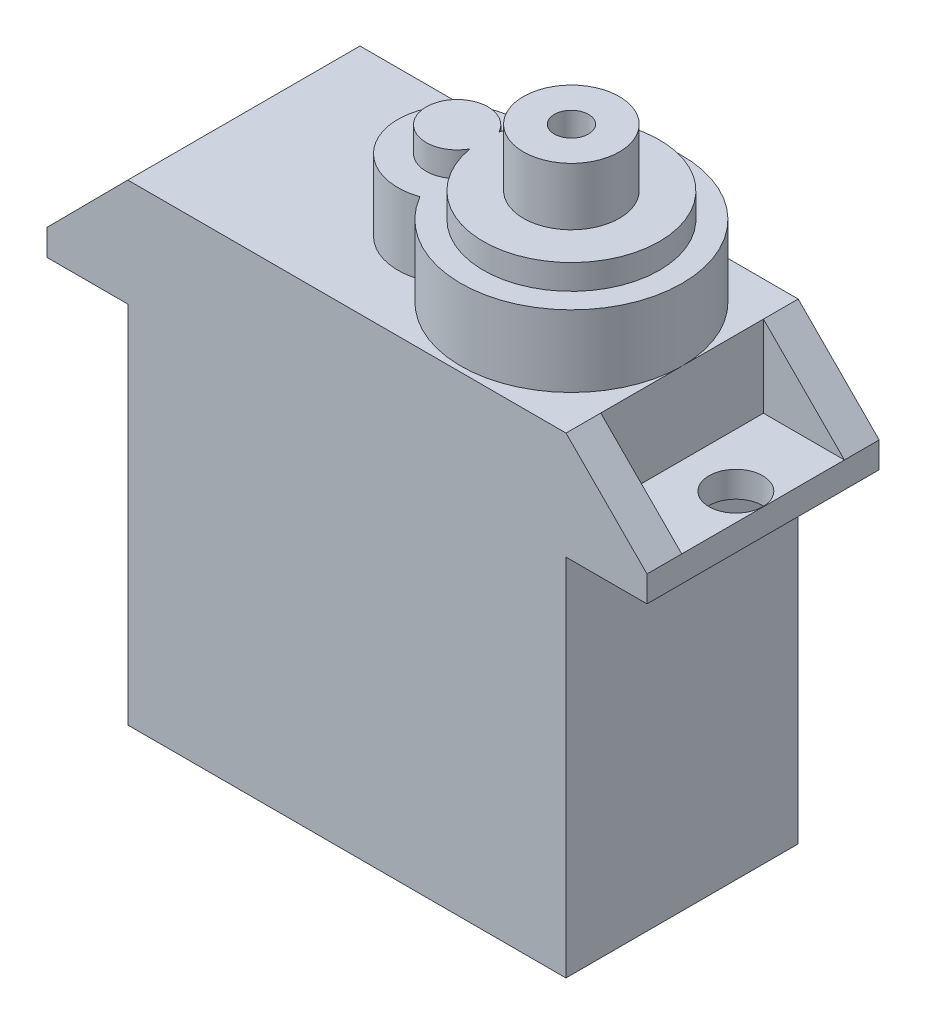
ISO-10303-21;
HEADER;
FILE_DESCRIPTION(('STEP AP214'),'2;1');
FILE_NAME('part.step','',(''),(''),'','','');
FILE_SCHEMA(('AUTOMOTIVE_DESIGN { 1 0 10303 214 1 1 1 1 }'));
ENDSEC;
DATA;
#1=APPLICATION_CONTEXT('core data for automotive mechanical design processes');
#2=APPLICATION_PROTOCOL_DEFINITION('international standard','automotive_design',2000,#1);
#3=PRODUCT_CONTEXT('',#1,'mechanical');
#4=PRODUCT('Part','Part','',(#3));
#5=PRODUCT_RELATED_PRODUCT_CATEGORY('part','',(#4));
#6=PRODUCT_DEFINITION_FORMATION('','',#4);
#7=PRODUCT_DEFINITION_CONTEXT('part definition',#1,'design');
#8=PRODUCT_DEFINITION('design','',#6,#7);
#9=PRODUCT_DEFINITION_SHAPE('','',#8);
#10=(LENGTH_UNIT() NAMED_UNIT(*) SI_UNIT(.MILLI.,.METRE.));
#11=(NAMED_UNIT(*) PLANE_ANGLE_UNIT() SI_UNIT($,.RADIAN.));
#12=(NAMED_UNIT(*) SI_UNIT($,.STERADIAN.) SOLID_ANGLE_UNIT());
#13=UNCERTAINTY_MEASURE_WITH_UNIT(LENGTH_MEASURE(1.E-05),#10,'distance_accuracy_value','');
#14=(GEOMETRIC_REPRESENTATION_CONTEXT(3) GLOBAL_UNCERTAINTY_ASSIGNED_CONTEXT((#13)) GLOBAL_UNIT_ASSIGNED_CONTEXT((#10,
#11,#12)) REPRESENTATION_CONTEXT('',''));
#15=CARTESIAN_POINT('',(0.,0.,0.));
#16=DIRECTION('',(0.,0.,1.));
#17=DIRECTION('',(1.,0.,0.));
#18=AXIS2_PLACEMENT_3D('',#15,#16,#17);
#19=CARTESIAN_POINT('',(0.,29.63,0.));
#20=DIRECTION('',(0.,1.,0.));
#21=DIRECTION('',(0.,0.,1.));
#22=AXIS2_PLACEMENT_3D('',#19,#20,#21);
#23=PLANE('',#22);
#24=CARTESIAN_POINT('',(-0.305000000000001,29.63,0.));
#25=DIRECTION('',(0.,1.,0.));
#26=DIRECTION('',(0.,0.,1.));
#27=AXIS2_PLACEMENT_3D('',#24,#25,#26);
#28=CIRCLE('',#27,1.61);
#29=CARTESIAN_POINT('',(1.12119857262804,29.63,-0.747032550451273));
#30=VERTEX_POINT('',#29);
#31=CARTESIAN_POINT('',(1.12119857262804,29.63,0.747032550451273));
#32=VERTEX_POINT('',#31);
#33=EDGE_CURVE('E221',#30,#32,#28,.T.);
#34=ORIENTED_EDGE('',*,*,#33,.T.);
#35=CARTESIAN_POINT('',(5.65,29.63,0.));
#36=DIRECTION('',(0.,1.,0.));
#37=DIRECTION('',(0.,0.,1.));
#38=AXIS2_PLACEMENT_3D('',#35,#36,#37);
#39=CIRCLE('',#38,4.59);
#40=EDGE_CURVE('E211',#32,#30,#39,.T.);
#41=ORIENTED_EDGE('',*,*,#40,.T.);
#42=EDGE_LOOP('',(#34,#41));
#43=FACE_BOUND('',#42,.T.);
#44=CARTESIAN_POINT('',(5.65,29.63,0.));
#45=DIRECTION('',(0.,1.,0.));
#46=DIRECTION('',(0.,0.,1.));
#47=AXIS2_PLACEMENT_3D('',#44,#45,#46);
#48=CIRCLE('',#47,2.5);
#49=CARTESIAN_POINT('',(5.65,29.63,2.5));
#50=VERTEX_POINT('',#49);
#51=EDGE_CURVE('E228',#50,#50,#48,.T.);
#52=ORIENTED_EDGE('',*,*,#51,.F.);
#53=EDGE_LOOP('',(#52));
#54=FACE_BOUND('',#53,.T.);
#55=ADVANCED_FACE('F66',(#43,#54),#23,.T.);
#56=CARTESIAN_POINT('',(0.,28.33,0.));
#57=DIRECTION('',(0.,1.,0.));
#58=DIRECTION('',(0.,0.,1.));
#59=AXIS2_PLACEMENT_3D('',#56,#57,#58);
#60=PLANE('',#59);
#61=CARTESIAN_POINT('',(-0.305000000000001,28.33,0.));
#62=DIRECTION('',(0.,1.,0.));
#63=DIRECTION('',(0.,0.,1.));
#64=AXIS2_PLACEMENT_3D('',#61,#62,#63);
#65=CIRCLE('',#64,3.085);
#66=CARTESIAN_POINT('',(0.676221662468512,28.33,-2.92479555680436));
#67=VERTEX_POINT('',#66);
#68=CARTESIAN_POINT('',(0.676221662468512,28.33,2.92479555680436));
#69=VERTEX_POINT('',#68);
#70=EDGE_CURVE('E233',#67,#69,#65,.T.);
#71=ORIENTED_EDGE('',*,*,#70,.T.);
#72=CARTESIAN_POINT('',(5.65,28.33,0.));
#73=DIRECTION('',(0.,1.,0.));
#74=DIRECTION('',(0.,0.,1.));
#75=AXIS2_PLACEMENT_3D('',#72,#73,#74);
#76=CIRCLE('',#75,5.77);
#77=EDGE_CURVE('E236',#69,#67,#76,.T.);
#78=ORIENTED_EDGE('',*,*,#77,.T.);
#79=EDGE_LOOP('',(#71,#78));
#80=FACE_BOUND('',#79,.T.);
#81=CARTESIAN_POINT('',(5.65,28.33,0.));
#82=DIRECTION('',(0.,1.,0.));
#83=DIRECTION('',(0.,0.,1.));
#84=AXIS2_PLACEMENT_3D('',#81,#82,#83);
#85=CIRCLE('',#84,4.59);
#86=CARTESIAN_POINT('',(1.12119857262804,28.33,0.747032550451273));
#87=VERTEX_POINT('',#86);
#88=CARTESIAN_POINT('',(1.12119857262804,28.33,-0.747032550451273));
#89=VERTEX_POINT('',#88);
#90=EDGE_CURVE('E214',#87,#89,#85,.T.);
#91=ORIENTED_EDGE('',*,*,#90,.F.);
#92=CARTESIAN_POINT('',(-0.305000000000001,28.33,0.));
#93=DIRECTION('',(0.,1.,0.));
#94=DIRECTION('',(0.,0.,1.));
#95=AXIS2_PLACEMENT_3D('',#92,#93,#94);
#96=CIRCLE('',#95,1.61);
#97=EDGE_CURVE('E83',#89,#87,#96,.T.);
#98=ORIENTED_EDGE('',*,*,#97,.F.);
#99=EDGE_LOOP('',(#91,#98));
#100=FACE_BOUND('',#99,.T.);
#101=ADVANCED_FACE('F451',(#80,#100),#60,.T.);
#102=CARTESIAN_POINT('',(-15.64,20.35,-6.05005));
#103=DIRECTION('',(0.709606840581156,-0.704597851118232,0.));
#104=DIRECTION('',(0.704597851118232,0.709606840581156,0.));
#105=AXIS2_PLACEMENT_3D('',#102,#103,#104);
#106=PLANE('',#105);
#107=DIRECTION('',(0.,0.,1.));
#108=VECTOR('',#107,1.);
#109=CARTESIAN_POINT('',(-15.64,20.35,-6.05005));
#110=LINE('',#109,#108);
#111=CARTESIAN_POINT('',(-15.64,20.35,-6.05));
#112=VERTEX_POINT('',#111);
#113=CARTESIAN_POINT('',(-15.64,20.35,-4.24));
#114=VERTEX_POINT('',#113);
#115=EDGE_CURVE('E306',#112,#114,#110,.T.);
#116=ORIENTED_EDGE('',*,*,#115,.T.);
#117=DIRECTION('',(0.704597851118232,0.709606840581156,0.));
#118=VECTOR('',#117,1.);
#119=CARTESIAN_POINT('',(-15.64,20.35,-4.24));
#120=LINE('',#119,#118);
#121=CARTESIAN_POINT('',(-11.42,24.6,-4.24));
#122=VERTEX_POINT('',#121);
#123=EDGE_CURVE('E70',#114,#122,#120,.T.);
#124=ORIENTED_EDGE('',*,*,#123,.T.);
#125=DIRECTION('',(0.,0.,-1.));
#126=VECTOR('',#125,1.);
#127=CARTESIAN_POINT('',(-11.42,24.6,0.));
#128=LINE('',#127,#126);
#129=CARTESIAN_POINT('',(-11.42,24.6,-6.05));
#130=VERTEX_POINT('',#129);
#131=EDGE_CURVE('E386',#122,#130,#128,.T.);
#132=ORIENTED_EDGE('',*,*,#131,.T.);
#133=DIRECTION('',(0.704597851118232,0.709606840581156,0.));
#134=VECTOR('',#133,1.);
#135=CARTESIAN_POINT('',(-14.2174474574098,21.7826654753575,-6.05));
#136=LINE('',#135,#134);
#137=EDGE_CURVE('E309',#112,#130,#136,.T.);
#138=ORIENTED_EDGE('',*,*,#137,.F.);
#139=EDGE_LOOP('',(#116,#124,#132,#138));
#140=FACE_BOUND('',#139,.T.);
#141=ADVANCED_FACE('F412',(#140),#106,.F.);
#142=CARTESIAN_POINT('',(15.64,20.35,-6.05005));
#143=DIRECTION('',(-0.709606840581156,-0.704597851118232,0.));
#144=DIRECTION('',(0.704597851118232,-0.709606840581156,0.));
#145=AXIS2_PLACEMENT_3D('',#142,#143,#144);
#146=PLANE('',#145);
#147=DIRECTION('',(0.,0.,1.));
#148=VECTOR('',#147,1.);
#149=CARTESIAN_POINT('',(11.42,24.6,0.));
#150=LINE('',#149,#148);
#151=CARTESIAN_POINT('',(11.42,24.6,-6.05));
#152=VERTEX_POINT('',#151);
#153=CARTESIAN_POINT('',(11.42,24.6,-4.24));
#154=VERTEX_POINT('',#153);
#155=EDGE_CURVE('E396',#152,#154,#150,.T.);
#156=ORIENTED_EDGE('',*,*,#155,.T.);
#157=DIRECTION('',(0.704597851118232,-0.709606840581156,0.));
#158=VECTOR('',#157,1.);
#159=CARTESIAN_POINT('',(15.64,20.35,-4.24));
#160=LINE('',#159,#158);
#161=CARTESIAN_POINT('',(15.64,20.35,-4.24));
#162=VERTEX_POINT('',#161);
#163=EDGE_CURVE('E402',#154,#162,#160,.T.);
#164=ORIENTED_EDGE('',*,*,#163,.T.);
#165=DIRECTION('',(0.,0.,1.));
#166=VECTOR('',#165,1.);
#167=CARTESIAN_POINT('',(15.64,20.35,-6.05005));
#168=LINE('',#167,#166);
#169=CARTESIAN_POINT('',(15.64,20.35,-6.05));
#170=VERTEX_POINT('',#169);
#171=EDGE_CURVE('E297',#170,#162,#168,.T.);
#172=ORIENTED_EDGE('',*,*,#171,.F.);
#173=DIRECTION('',(0.704597851118232,-0.709606840581156,0.));
#174=VECTOR('',#173,1.);
#175=CARTESIAN_POINT('',(2.88330830840596,33.1973790732878,-6.05));
#176=LINE('',#175,#174);
#177=EDGE_CURVE('E300',#152,#170,#176,.T.);
#178=ORIENTED_EDGE('',*,*,#177,.F.);
#179=EDGE_LOOP('',(#156,#164,#172,#178));
#180=FACE_BOUND('',#179,.T.);
#181=ADVANCED_FACE('F533',(#180),#146,.F.);
#182=CARTESIAN_POINT('',(11.415,19.,-6.05));
#183=DIRECTION('',(-1.,0.,0.));
#184=DIRECTION('',(0.,0.,1.));
#185=AXIS2_PLACEMENT_3D('',#182,#183,#184);
#186=PLANE('',#185);
#187=DIRECTION('',(0.,0.,-1.));
#188=VECTOR('',#187,1.);
#189=CARTESIAN_POINT('',(11.415,0.,-6.05));
#190=LINE('',#189,#188);
#191=CARTESIAN_POINT('',(11.415,0.,6.05));
#192=VERTEX_POINT('',#191);
#193=CARTESIAN_POINT('',(11.415,0.,-6.05));
#194=VERTEX_POINT('',#193);
#195=EDGE_CURVE('E347',#192,#194,#190,.T.);
#196=ORIENTED_EDGE('',*,*,#195,.T.);
#197=DIRECTION('',(0.,-1.,0.));
#198=VECTOR('',#197,1.);
#199=CARTESIAN_POINT('',(11.415,19.,-6.05));
#200=LINE('',#199,#198);
#201=CARTESIAN_POINT('',(11.415,19.,-6.05));
#202=VERTEX_POINT('',#201);
#203=EDGE_CURVE('E378',#202,#194,#200,.T.);
#204=ORIENTED_EDGE('',*,*,#203,.F.);
#205=DIRECTION('',(0.,0.,-1.));
#206=VECTOR('',#205,1.);
#207=CARTESIAN_POINT('',(11.415,19.,-6.05));
#208=LINE('',#207,#206);
#209=CARTESIAN_POINT('',(11.415,19.,6.05));
#210=VERTEX_POINT('',#209);
#211=EDGE_CURVE('E365',#210,#202,#208,.T.);
#212=ORIENTED_EDGE('',*,*,#211,.F.);
#213=DIRECTION('',(0.,-1.,0.));
#214=VECTOR('',#213,1.);
#215=CARTESIAN_POINT('',(11.415,19.,6.05));
#216=LINE('',#215,#214);
#217=EDGE_CURVE('E370',#210,#192,#216,.T.);
#218=ORIENTED_EDGE('',*,*,#217,.T.);
#219=EDGE_LOOP('',(#196,#204,#212,#218));
#220=FACE_BOUND('',#219,.T.);
#221=ADVANCED_FACE('F68',(#220),#186,.F.);
#222=CARTESIAN_POINT('',(-11.415,19.,-6.05));
#223=DIRECTION('',(0.,0.,1.));
#224=DIRECTION('',(1.,0.,0.));
#225=AXIS2_PLACEMENT_3D('',#222,#223,#224);
#226=PLANE('',#225);
#227=DIRECTION('',(-1.,0.,0.));
#228=VECTOR('',#227,1.);
#229=CARTESIAN_POINT('',(-15.64,24.6,-6.05));
#230=LINE('',#229,#228);
#231=EDGE_CURVE('E313',#152,#130,#230,.T.);
#232=ORIENTED_EDGE('',*,*,#231,.F.);
#233=ORIENTED_EDGE('',*,*,#177,.T.);
#234=DIRECTION('',(0.,-1.,0.));
#235=VECTOR('',#234,1.);
#236=CARTESIAN_POINT('',(15.64,24.6,-6.05));
#237=LINE('',#236,#235);
#238=CARTESIAN_POINT('',(15.64,19.,-6.05));
#239=VERTEX_POINT('',#238);
#240=EDGE_CURVE('E346',#170,#239,#237,.T.);
#241=ORIENTED_EDGE('',*,*,#240,.T.);
#242=DIRECTION('',(-1.,0.,0.));
#243=VECTOR('',#242,1.);
#244=CARTESIAN_POINT('',(-15.64,19.,-6.05));
#245=LINE('',#244,#243);
#246=EDGE_CURVE('E332',#239,#202,#245,.T.);
#247=ORIENTED_EDGE('',*,*,#246,.T.);
#248=ORIENTED_EDGE('',*,*,#203,.T.);
#249=DIRECTION('',(-1.,0.,0.));
#250=VECTOR('',#249,1.);
#251=CARTESIAN_POINT('',(-11.415,0.,-6.05));
#252=LINE('',#251,#250);
#253=CARTESIAN_POINT('',(-11.415,0.,-6.05));
#254=VERTEX_POINT('',#253);
#255=EDGE_CURVE('E352',#194,#254,#252,.T.);
#256=ORIENTED_EDGE('',*,*,#255,.T.);
#257=DIRECTION('',(0.,-1.,0.));
#258=VECTOR('',#257,1.);
#259=CARTESIAN_POINT('',(-11.415,19.,-6.05));
#260=LINE('',#259,#258);
#261=CARTESIAN_POINT('',(-11.415,19.,-6.05));
#262=VERTEX_POINT('',#261);
#263=EDGE_CURVE('E369',#262,#254,#260,.T.);
#264=ORIENTED_EDGE('',*,*,#263,.F.);
#265=CARTESIAN_POINT('',(-15.64,19.,-6.05));
#266=VERTEX_POINT('',#265);
#267=EDGE_CURVE('E323',#262,#266,#245,.T.);
#268=ORIENTED_EDGE('',*,*,#267,.T.);
#269=DIRECTION('',(0.,-1.,0.));
#270=VECTOR('',#269,1.);
#271=CARTESIAN_POINT('',(-15.64,24.6,-6.05));
#272=LINE('',#271,#270);
#273=EDGE_CURVE('E345',#112,#266,#272,.T.);
#274=ORIENTED_EDGE('',*,*,#273,.F.);
#275=ORIENTED_EDGE('',*,*,#137,.T.);
#276=EDGE_LOOP('',(#232,#233,#241,#247,#248,#256,#264,#268,#274,#275));
#277=FACE_BOUND('',#276,.T.);
#278=ADVANCED_FACE('F422',(#277),#226,.F.);
#279=CARTESIAN_POINT('',(-11.415,19.,-6.05));
#280=DIRECTION('',(1.,0.,0.));
#281=DIRECTION('',(0.,0.,-1.));
#282=AXIS2_PLACEMENT_3D('',#279,#280,#281);
#283=PLANE('',#282);
#284=DIRECTION('',(0.,0.,1.));
#285=VECTOR('',#284,1.);
#286=CARTESIAN_POINT('',(-11.415,0.,-6.05));
#287=LINE('',#286,#285);
#288=CARTESIAN_POINT('',(-11.415,0.,6.05));
#289=VERTEX_POINT('',#288);
#290=EDGE_CURVE('E357',#254,#289,#287,.T.);
#291=ORIENTED_EDGE('',*,*,#290,.T.);
#292=DIRECTION('',(0.,-1.,0.));
#293=VECTOR('',#292,1.);
#294=CARTESIAN_POINT('',(-11.415,19.,6.05));
#295=LINE('',#294,#293);
#296=CARTESIAN_POINT('',(-11.415,19.,6.05));
#297=VERTEX_POINT('',#296);
#298=EDGE_CURVE('E366',#297,#289,#295,.T.);
#299=ORIENTED_EDGE('',*,*,#298,.F.);
#300=DIRECTION('',(0.,0.,1.));
#301=VECTOR('',#300,1.);
#302=CARTESIAN_POINT('',(-11.415,19.,-6.05));
#303=LINE('',#302,#301);
#304=EDGE_CURVE('E373',#262,#297,#303,.T.);
#305=ORIENTED_EDGE('',*,*,#304,.F.);
#306=ORIENTED_EDGE('',*,*,#263,.T.);
#307=EDGE_LOOP('',(#291,#299,#305,#306));
#308=FACE_BOUND('',#307,.T.);
#309=ADVANCED_FACE('F503',(#308),#283,.F.);
#310=CARTESIAN_POINT('',(-11.415,19.,6.05));
#311=DIRECTION('',(0.,0.,-1.));
#312=DIRECTION('',(-1.,0.,0.));
#313=AXIS2_PLACEMENT_3D('',#310,#311,#312);
#314=PLANE('',#313);
#315=DIRECTION('',(0.,-1.,0.));
#316=VECTOR('',#315,1.);
#317=CARTESIAN_POINT('',(15.64,24.6,6.05));
#318=LINE('',#317,#316);
#319=CARTESIAN_POINT('',(15.64,20.35,6.05));
#320=VERTEX_POINT('',#319);
#321=CARTESIAN_POINT('',(15.64,19.,6.05));
#322=VERTEX_POINT('',#321);
#323=EDGE_CURVE('E320',#320,#322,#318,.T.);
#324=ORIENTED_EDGE('',*,*,#323,.F.);
#325=DIRECTION('',(0.704597851118232,-0.709606840581156,0.));
#326=VECTOR('',#325,1.);
#327=CARTESIAN_POINT('',(15.64,20.35,6.05));
#328=LINE('',#327,#326);
#329=CARTESIAN_POINT('',(11.42,24.6,6.05));
#330=VERTEX_POINT('',#329);
#331=EDGE_CURVE('E293',#330,#320,#328,.T.);
#332=ORIENTED_EDGE('',*,*,#331,.F.);
#333=DIRECTION('',(1.,0.,0.));
#334=VECTOR('',#333,1.);
#335=CARTESIAN_POINT('',(-15.64,24.6,6.05));
#336=LINE('',#335,#334);
#337=CARTESIAN_POINT('',(-11.42,24.6,6.05));
#338=VERTEX_POINT('',#337);
#339=EDGE_CURVE('E316',#338,#330,#336,.T.);
#340=ORIENTED_EDGE('',*,*,#339,.F.);
#341=DIRECTION('',(0.704597851118232,0.709606840581156,0.));
#342=VECTOR('',#341,1.);
#343=CARTESIAN_POINT('',(-15.64,20.35,6.05));
#344=LINE('',#343,#342);
#345=CARTESIAN_POINT('',(-15.64,20.35,6.05));
#346=VERTEX_POINT('',#345);
#347=EDGE_CURVE('E303',#346,#338,#344,.T.);
#348=ORIENTED_EDGE('',*,*,#347,.F.);
#349=DIRECTION('',(0.,-1.,0.));
#350=VECTOR('',#349,1.);
#351=CARTESIAN_POINT('',(-15.64,24.6,6.05));
#352=LINE('',#351,#350);
#353=CARTESIAN_POINT('',(-15.64,19.,6.05));
#354=VERTEX_POINT('',#353);
#355=EDGE_CURVE('E343',#346,#354,#352,.T.);
#356=ORIENTED_EDGE('',*,*,#355,.T.);
#357=DIRECTION('',(1.,0.,0.));
#358=VECTOR('',#357,1.);
#359=CARTESIAN_POINT('',(-15.64,19.,6.05));
#360=LINE('',#359,#358);
#361=EDGE_CURVE('E317',#354,#297,#360,.T.);
#362=ORIENTED_EDGE('',*,*,#361,.T.);
#363=ORIENTED_EDGE('',*,*,#298,.T.);
#364=DIRECTION('',(1.,0.,0.));
#365=VECTOR('',#364,1.);
#366=CARTESIAN_POINT('',(-11.415,0.,6.05));
#367=LINE('',#366,#365);
#368=EDGE_CURVE('E363',#289,#192,#367,.T.);
#369=ORIENTED_EDGE('',*,*,#368,.T.);
#370=ORIENTED_EDGE('',*,*,#217,.F.);
#371=EDGE_CURVE('E335',#210,#322,#360,.T.);
#372=ORIENTED_EDGE('',*,*,#371,.T.);
#373=EDGE_LOOP('',(#324,#332,#340,#348,#356,#362,#363,#369,#370,#372));
#374=FACE_BOUND('',#373,.T.);
#375=ADVANCED_FACE('F507',(#374),#314,.F.);
#376=CARTESIAN_POINT('',(0.,0.,0.));
#377=DIRECTION('',(0.,1.,0.));
#378=DIRECTION('',(0.,0.,1.));
#379=AXIS2_PLACEMENT_3D('',#376,#377,#378);
#380=PLANE('',#379);
#381=ORIENTED_EDGE('',*,*,#195,.F.);
#382=ORIENTED_EDGE('',*,*,#368,.F.);
#383=ORIENTED_EDGE('',*,*,#290,.F.);
#384=ORIENTED_EDGE('',*,*,#255,.F.);
#385=EDGE_LOOP('',(#381,#382,#383,#384));
#386=FACE_BOUND('',#385,.T.);
#387=ADVANCED_FACE('F509',(#386),#380,.F.);
#388=CARTESIAN_POINT('',(0.,19.,0.));
#389=DIRECTION('',(0.,1.,0.));
#390=DIRECTION('',(0.,0.,1.));
#391=AXIS2_PLACEMENT_3D('',#388,#389,#390);
#392=PLANE('',#391);
#393=CARTESIAN_POINT('',(14.22,19.,0.));
#394=DIRECTION('',(0.,1.,0.));
#395=DIRECTION('',(0.,0.,1.));
#396=AXIS2_PLACEMENT_3D('',#393,#394,#395);
#397=CIRCLE('',#396,1.4);
#398=CARTESIAN_POINT('',(14.22,19.,1.4));
#399=VERTEX_POINT('',#398);
#400=EDGE_CURVE('E254',#399,#399,#397,.F.);
#401=ORIENTED_EDGE('',*,*,#400,.F.);
#402=EDGE_LOOP('',(#401));
#403=FACE_BOUND('',#402,.T.);
#404=ORIENTED_EDGE('',*,*,#371,.F.);
#405=ORIENTED_EDGE('',*,*,#211,.T.);
#406=ORIENTED_EDGE('',*,*,#246,.F.);
#407=DIRECTION('',(0.,0.,-1.));
#408=VECTOR('',#407,1.);
#409=CARTESIAN_POINT('',(15.64,19.,-6.05));
#410=LINE('',#409,#408);
#411=EDGE_CURVE('E312',#322,#239,#410,.T.);
#412=ORIENTED_EDGE('',*,*,#411,.F.);
#413=EDGE_LOOP('',(#404,#405,#406,#412));
#414=FACE_BOUND('',#413,.T.);
#415=ADVANCED_FACE('F494',(#403,#414),#392,.F.);
#416=CARTESIAN_POINT('',(-14.22,19.,0.));
#417=DIRECTION('',(0.,1.,0.));
#418=DIRECTION('',(0.,0.,1.));
#419=AXIS2_PLACEMENT_3D('',#416,#417,#418);
#420=CIRCLE('',#419,1.4);
#421=CARTESIAN_POINT('',(-14.22,19.,1.4));
#422=VERTEX_POINT('',#421);
#423=EDGE_CURVE('E248',#422,#422,#420,.F.);
#424=ORIENTED_EDGE('',*,*,#423,.F.);
#425=EDGE_LOOP('',(#424));
#426=FACE_BOUND('',#425,.T.);
#427=ORIENTED_EDGE('',*,*,#267,.F.);
#428=ORIENTED_EDGE('',*,*,#304,.T.);
#429=ORIENTED_EDGE('',*,*,#361,.F.);
#430=DIRECTION('',(0.,0.,1.));
#431=VECTOR('',#430,1.);
#432=CARTESIAN_POINT('',(-15.64,19.,-6.05));
#433=LINE('',#432,#431);
#434=EDGE_CURVE('E326',#266,#354,#433,.T.);
#435=ORIENTED_EDGE('',*,*,#434,.F.);
#436=EDGE_LOOP('',(#427,#428,#429,#435));
#437=FACE_BOUND('',#436,.T.);
#438=ADVANCED_FACE('F490',(#426,#437),#392,.F.);
#439=CARTESIAN_POINT('',(15.64,24.6,-6.05));
#440=DIRECTION('',(-1.,0.,0.));
#441=DIRECTION('',(0.,0.,1.));
#442=AXIS2_PLACEMENT_3D('',#439,#440,#441);
#443=PLANE('',#442);
#444=ORIENTED_EDGE('',*,*,#240,.F.);
#445=ORIENTED_EDGE('',*,*,#171,.T.);
#446=DIRECTION('',(0.,0.,1.));
#447=VECTOR('',#446,1.);
#448=CARTESIAN_POINT('',(15.64,20.35,-4.24));
#449=LINE('',#448,#447);
#450=CARTESIAN_POINT('',(15.64,20.35,4.24));
#451=VERTEX_POINT('',#450);
#452=EDGE_CURVE('E275',#162,#451,#449,.T.);
#453=ORIENTED_EDGE('',*,*,#452,.T.);
#454=EDGE_CURVE('E296',#451,#320,#168,.T.);
#455=ORIENTED_EDGE('',*,*,#454,.T.);
#456=ORIENTED_EDGE('',*,*,#323,.T.);
#457=ORIENTED_EDGE('',*,*,#411,.T.);
#458=EDGE_LOOP('',(#444,#445,#453,#455,#456,#457));
#459=FACE_BOUND('',#458,.T.);
#460=ADVANCED_FACE('F493',(#459),#443,.F.);
#461=CARTESIAN_POINT('',(-15.64,24.6,-6.05));
#462=DIRECTION('',(1.,0.,0.));
#463=DIRECTION('',(0.,0.,-1.));
#464=AXIS2_PLACEMENT_3D('',#461,#462,#463);
#465=PLANE('',#464);
#466=ORIENTED_EDGE('',*,*,#355,.F.);
#467=CARTESIAN_POINT('',(-15.64,20.35,4.24));
#468=VERTEX_POINT('',#467);
#469=EDGE_CURVE('E305',#468,#346,#110,.T.);
#470=ORIENTED_EDGE('',*,*,#469,.F.);
#471=DIRECTION('',(0.,0.,-1.));
#472=VECTOR('',#471,1.);
#473=CARTESIAN_POINT('',(-15.64,20.35,-4.24));
#474=LINE('',#473,#472);
#475=EDGE_CURVE('E263',#468,#114,#474,.T.);
#476=ORIENTED_EDGE('',*,*,#475,.T.);
#477=ORIENTED_EDGE('',*,*,#115,.F.);
#478=ORIENTED_EDGE('',*,*,#273,.T.);
#479=ORIENTED_EDGE('',*,*,#434,.T.);
#480=EDGE_LOOP('',(#466,#470,#476,#477,#478,#479));
#481=FACE_BOUND('',#480,.T.);
#482=ADVANCED_FACE('F426',(#481),#465,.F.);
#483=CARTESIAN_POINT('',(0.,24.6,0.));
#484=DIRECTION('',(0.,1.,0.));
#485=DIRECTION('',(0.,0.,1.));
#486=AXIS2_PLACEMENT_3D('',#483,#484,#485);
#487=PLANE('',#486);
#488=CARTESIAN_POINT('',(-0.305000000000001,24.6,0.));
#489=DIRECTION('',(0.,1.,0.));
#490=DIRECTION('',(0.,0.,1.));
#491=AXIS2_PLACEMENT_3D('',#488,#489,#490);
#492=CIRCLE('',#491,3.085);
#493=CARTESIAN_POINT('',(0.676221662468512,24.6,-2.92479555680436));
#494=VERTEX_POINT('',#493);
#495=CARTESIAN_POINT('',(0.676221662468512,24.6,2.92479555680436));
#496=VERTEX_POINT('',#495);
#497=EDGE_CURVE('E216',#494,#496,#492,.T.);
#498=ORIENTED_EDGE('',*,*,#497,.F.);
#499=CARTESIAN_POINT('',(5.65,24.6,0.));
#500=DIRECTION('',(0.,1.,0.));
#501=DIRECTION('',(0.,0.,1.));
#502=AXIS2_PLACEMENT_3D('',#499,#500,#501);
#503=CIRCLE('',#502,5.77);
#504=CARTESIAN_POINT('',(11.42,24.6,0.));
#505=VERTEX_POINT('',#504);
#506=EDGE_CURVE('E13',#505,#494,#503,.T.);
#507=ORIENTED_EDGE('',*,*,#506,.F.);
#508=DIRECTION('',(0.,0.,1.));
#509=VECTOR('',#508,1.);
#510=CARTESIAN_POINT('',(11.42,24.6,-4.24));
#511=LINE('',#510,#509);
#512=EDGE_CURVE('E284',#154,#505,#511,.T.);
#513=ORIENTED_EDGE('',*,*,#512,.F.);
#514=ORIENTED_EDGE('',*,*,#155,.F.);
#515=ORIENTED_EDGE('',*,*,#231,.T.);
#516=ORIENTED_EDGE('',*,*,#131,.F.);
#517=DIRECTION('',(0.,0.,-1.));
#518=VECTOR('',#517,1.);
#519=CARTESIAN_POINT('',(-11.42,24.6,-4.24));
#520=LINE('',#519,#518);
#521=CARTESIAN_POINT('',(-11.42,24.6,4.24));
#522=VERTEX_POINT('',#521);
#523=EDGE_CURVE('E257',#522,#122,#520,.T.);
#524=ORIENTED_EDGE('',*,*,#523,.F.);
#525=EDGE_CURVE('E392',#338,#522,#128,.T.);
#526=ORIENTED_EDGE('',*,*,#525,.F.);
#527=ORIENTED_EDGE('',*,*,#339,.T.);
#528=CARTESIAN_POINT('',(11.42,24.6,4.24));
#529=VERTEX_POINT('',#528);
#530=EDGE_CURVE('E395',#529,#330,#150,.T.);
#531=ORIENTED_EDGE('',*,*,#530,.F.);
#532=EDGE_CURVE('E274',#505,#529,#511,.T.);
#533=ORIENTED_EDGE('',*,*,#532,.F.);
#534=EDGE_CURVE('E76',#496,#505,#503,.T.);
#535=ORIENTED_EDGE('',*,*,#534,.F.);
#536=EDGE_LOOP('',(#498,#507,#513,#514,#515,#516,#524,#526,#527,#531,#533,#535));
#537=FACE_BOUND('',#536,.T.);
#538=ADVANCED_FACE('F416',(#537),#487,.T.);
#539=ORIENTED_EDGE('',*,*,#525,.T.);
#540=DIRECTION('',(-0.704597851118232,-0.709606840581156,0.));
#541=VECTOR('',#540,1.);
#542=CARTESIAN_POINT('',(-15.64,20.35,4.24));
#543=LINE('',#542,#541);
#544=EDGE_CURVE('E404',#522,#468,#543,.T.);
#545=ORIENTED_EDGE('',*,*,#544,.T.);
#546=ORIENTED_EDGE('',*,*,#469,.T.);
#547=ORIENTED_EDGE('',*,*,#347,.T.);
#548=EDGE_LOOP('',(#539,#545,#546,#547));
#549=FACE_BOUND('',#548,.T.);
#550=ADVANCED_FACE('F524',(#549),#106,.F.);
#551=ORIENTED_EDGE('',*,*,#454,.F.);
#552=DIRECTION('',(-0.704597851118232,0.709606840581156,0.));
#553=VECTOR('',#552,1.);
#554=CARTESIAN_POINT('',(15.64,20.35,4.24));
#555=LINE('',#554,#553);
#556=EDGE_CURVE('E399',#451,#529,#555,.T.);
#557=ORIENTED_EDGE('',*,*,#556,.T.);
#558=ORIENTED_EDGE('',*,*,#530,.T.);
#559=ORIENTED_EDGE('',*,*,#331,.T.);
#560=EDGE_LOOP('',(#551,#557,#558,#559));
#561=FACE_BOUND('',#560,.T.);
#562=ADVANCED_FACE('F520',(#561),#146,.F.);
#563=CARTESIAN_POINT('',(15.64,9.52799915540544,-4.24));
#564=DIRECTION('',(0.,0.,-1.));
#565=DIRECTION('',(-1.,0.,0.));
#566=AXIS2_PLACEMENT_3D('',#563,#564,#565);
#567=PLANE('',#566);
#568=DIRECTION('',(0.,1.,0.));
#569=VECTOR('',#568,1.);
#570=CARTESIAN_POINT('',(11.42,9.52799915540544,-4.24));
#571=LINE('',#570,#569);
#572=CARTESIAN_POINT('',(11.42,20.35,-4.24));
#573=VERTEX_POINT('',#572);
#574=EDGE_CURVE('E279',#573,#154,#571,.T.);
#575=ORIENTED_EDGE('',*,*,#574,.F.);
#576=DIRECTION('',(1.,0.,0.));
#577=VECTOR('',#576,1.);
#578=CARTESIAN_POINT('',(15.64,20.35,-4.24));
#579=LINE('',#578,#577);
#580=EDGE_CURVE('E278',#573,#162,#579,.T.);
#581=ORIENTED_EDGE('',*,*,#580,.T.);
#582=ORIENTED_EDGE('',*,*,#163,.F.);
#583=EDGE_LOOP('',(#575,#581,#582));
#584=FACE_BOUND('',#583,.T.);
#585=ADVANCED_FACE('F531',(#584),#567,.F.);
#586=CARTESIAN_POINT('',(15.64,9.52799915540544,4.24));
#587=DIRECTION('',(0.,0.,1.));
#588=DIRECTION('',(1.,0.,0.));
#589=AXIS2_PLACEMENT_3D('',#586,#587,#588);
#590=PLANE('',#589);
#591=DIRECTION('',(-1.,0.,0.));
#592=VECTOR('',#591,1.);
#593=CARTESIAN_POINT('',(15.64,20.35,4.24));
#594=LINE('',#593,#592);
#595=CARTESIAN_POINT('',(11.42,20.35,4.24));
#596=VERTEX_POINT('',#595);
#597=EDGE_CURVE('E283',#451,#596,#594,.T.);
#598=ORIENTED_EDGE('',*,*,#597,.T.);
#599=DIRECTION('',(0.,1.,0.));
#600=VECTOR('',#599,1.);
#601=CARTESIAN_POINT('',(11.42,9.52799915540544,4.24));
#602=LINE('',#601,#600);
#603=EDGE_CURVE('E287',#596,#529,#602,.T.);
#604=ORIENTED_EDGE('',*,*,#603,.T.);
#605=ORIENTED_EDGE('',*,*,#556,.F.);
#606=EDGE_LOOP('',(#598,#604,#605));
#607=FACE_BOUND('',#606,.T.);
#608=ADVANCED_FACE('F547',(#607),#590,.F.);
#609=CARTESIAN_POINT('',(11.42,9.52799915540544,-4.24));
#610=DIRECTION('',(-1.,0.,0.));
#611=DIRECTION('',(0.,0.,1.));
#612=AXIS2_PLACEMENT_3D('',#609,#610,#611);
#613=PLANE('',#612);
#614=DIRECTION('',(0.,0.,-1.));
#615=VECTOR('',#614,1.);
#616=CARTESIAN_POINT('',(11.42,20.35,-4.24));
#617=LINE('',#616,#615);
#618=EDGE_CURVE('E281',#596,#573,#617,.T.);
#619=ORIENTED_EDGE('',*,*,#618,.T.);
#620=ORIENTED_EDGE('',*,*,#574,.T.);
#621=ORIENTED_EDGE('',*,*,#512,.T.);
#622=ORIENTED_EDGE('',*,*,#532,.T.);
#623=ORIENTED_EDGE('',*,*,#603,.F.);
#624=EDGE_LOOP('',(#619,#620,#621,#622,#623));
#625=FACE_BOUND('',#624,.T.);
#626=ADVANCED_FACE('F544',(#625),#613,.F.);
#627=CARTESIAN_POINT('',(0.,20.35,0.));
#628=DIRECTION('',(0.,1.,0.));
#629=DIRECTION('',(0.,0.,1.));
#630=AXIS2_PLACEMENT_3D('',#627,#628,#629);
#631=PLANE('',#630);
#632=CARTESIAN_POINT('',(14.22,20.35,0.));
#633=DIRECTION('',(0.,1.,0.));
#634=DIRECTION('',(0.,0.,1.));
#635=AXIS2_PLACEMENT_3D('',#632,#633,#634);
#636=CIRCLE('',#635,1.4);
#637=CARTESIAN_POINT('',(14.22,20.35,1.4));
#638=VERTEX_POINT('',#637);
#639=EDGE_CURVE('E251',#638,#638,#636,.T.);
#640=ORIENTED_EDGE('',*,*,#639,.F.);
#641=EDGE_LOOP('',(#640));
#642=FACE_BOUND('',#641,.T.);
#643=ORIENTED_EDGE('',*,*,#618,.F.);
#644=ORIENTED_EDGE('',*,*,#597,.F.);
#645=ORIENTED_EDGE('',*,*,#452,.F.);
#646=ORIENTED_EDGE('',*,*,#580,.F.);
#647=EDGE_LOOP('',(#643,#644,#645,#646));
#648=FACE_BOUND('',#647,.T.);
#649=ADVANCED_FACE('F447',(#642,#648),#631,.T.);
#650=CARTESIAN_POINT('',(-15.64,9.52799915540544,-4.24));
#651=DIRECTION('',(0.,0.,-1.));
#652=DIRECTION('',(-1.,0.,0.));
#653=AXIS2_PLACEMENT_3D('',#650,#651,#652);
#654=PLANE('',#653);
#655=DIRECTION('',(1.,0.,0.));
#656=VECTOR('',#655,1.);
#657=CARTESIAN_POINT('',(-15.64,20.35,-4.24));
#658=LINE('',#657,#656);
#659=CARTESIAN_POINT('',(-11.42,20.35,-4.24));
#660=VERTEX_POINT('',#659);
#661=EDGE_CURVE('E260',#114,#660,#658,.T.);
#662=ORIENTED_EDGE('',*,*,#661,.T.);
#663=DIRECTION('',(0.,1.,0.));
#664=VECTOR('',#663,1.);
#665=CARTESIAN_POINT('',(-11.42,9.52799915540544,-4.24));
#666=LINE('',#665,#664);
#667=EDGE_CURVE('E261',#660,#122,#666,.T.);
#668=ORIENTED_EDGE('',*,*,#667,.T.);
#669=ORIENTED_EDGE('',*,*,#123,.F.);
#670=EDGE_LOOP('',(#662,#668,#669));
#671=FACE_BOUND('',#670,.T.);
#672=ADVANCED_FACE('F434',(#671),#654,.F.);
#673=CARTESIAN_POINT('',(-15.64,9.52799915540544,4.24));
#674=DIRECTION('',(0.,0.,1.));
#675=DIRECTION('',(1.,0.,0.));
#676=AXIS2_PLACEMENT_3D('',#673,#674,#675);
#677=PLANE('',#676);
#678=DIRECTION('',(0.,1.,0.));
#679=VECTOR('',#678,1.);
#680=CARTESIAN_POINT('',(-11.42,9.52799915540544,4.24));
#681=LINE('',#680,#679);
#682=CARTESIAN_POINT('',(-11.42,20.35,4.24));
#683=VERTEX_POINT('',#682);
#684=EDGE_CURVE('E269',#683,#522,#681,.T.);
#685=ORIENTED_EDGE('',*,*,#684,.F.);
#686=DIRECTION('',(-1.,0.,0.));
#687=VECTOR('',#686,1.);
#688=CARTESIAN_POINT('',(-15.64,20.35,4.24));
#689=LINE('',#688,#687);
#690=EDGE_CURVE('E266',#683,#468,#689,.T.);
#691=ORIENTED_EDGE('',*,*,#690,.T.);
#692=ORIENTED_EDGE('',*,*,#544,.F.);
#693=EDGE_LOOP('',(#685,#691,#692));
#694=FACE_BOUND('',#693,.T.);
#695=ADVANCED_FACE('F439',(#694),#677,.F.);
#696=CARTESIAN_POINT('',(-11.42,9.52799915540544,-4.24));
#697=DIRECTION('',(1.,0.,0.));
#698=DIRECTION('',(0.,0.,-1.));
#699=AXIS2_PLACEMENT_3D('',#696,#697,#698);
#700=PLANE('',#699);
#701=DIRECTION('',(0.,0.,1.));
#702=VECTOR('',#701,1.);
#703=CARTESIAN_POINT('',(-11.42,20.35,-4.24));
#704=LINE('',#703,#702);
#705=EDGE_CURVE('E258',#660,#683,#704,.T.);
#706=ORIENTED_EDGE('',*,*,#705,.T.);
#707=ORIENTED_EDGE('',*,*,#684,.T.);
#708=ORIENTED_EDGE('',*,*,#523,.T.);
#709=ORIENTED_EDGE('',*,*,#667,.F.);
#710=EDGE_LOOP('',(#706,#707,#708,#709));
#711=FACE_BOUND('',#710,.T.);
#712=ADVANCED_FACE('F436',(#711),#700,.F.);
#713=CARTESIAN_POINT('',(0.,20.35,0.));
#714=DIRECTION('',(0.,1.,0.));
#715=DIRECTION('',(0.,0.,1.));
#716=AXIS2_PLACEMENT_3D('',#713,#714,#715);
#717=PLANE('',#716);
#718=CARTESIAN_POINT('',(-14.22,20.35,0.));
#719=DIRECTION('',(0.,1.,0.));
#720=DIRECTION('',(0.,0.,-1.));
#721=AXIS2_PLACEMENT_3D('',#718,#719,#720);
#722=CIRCLE('',#721,1.4);
#723=CARTESIAN_POINT('',(-14.22,20.35,-1.4));
#724=VERTEX_POINT('',#723);
#725=EDGE_CURVE('E245',#724,#724,#722,.T.);
#726=ORIENTED_EDGE('',*,*,#725,.F.);
#727=EDGE_LOOP('',(#726));
#728=FACE_BOUND('',#727,.T.);
#729=ORIENTED_EDGE('',*,*,#475,.F.);
#730=ORIENTED_EDGE('',*,*,#690,.F.);
#731=ORIENTED_EDGE('',*,*,#705,.F.);
#732=ORIENTED_EDGE('',*,*,#661,.F.);
#733=EDGE_LOOP('',(#729,#730,#731,#732));
#734=FACE_BOUND('',#733,.T.);
#735=ADVANCED_FACE('F431',(#728,#734),#717,.T.);
#736=CARTESIAN_POINT('',(14.22,-0.00102500000000172,0.));
#737=DIRECTION('',(0.,1.,0.));
#738=DIRECTION('',(0.,0.,1.));
#739=AXIS2_PLACEMENT_3D('',#736,#737,#738);
#740=CYLINDRICAL_SURFACE('',#739,1.4);
#741=ORIENTED_EDGE('',*,*,#639,.T.);
#742=EDGE_LOOP('',(#741));
#743=FACE_BOUND('',#742,.T.);
#744=ORIENTED_EDGE('',*,*,#400,.T.);
#745=EDGE_LOOP('',(#744));
#746=FACE_BOUND('',#745,.T.);
#747=ADVANCED_FACE('F477',(#743,#746),#740,.F.);
#748=CARTESIAN_POINT('',(-14.22,-0.00102500000000172,0.));
#749=DIRECTION('',(0.,1.,0.));
#750=DIRECTION('',(0.,0.,1.));
#751=AXIS2_PLACEMENT_3D('',#748,#749,#750);
#752=CYLINDRICAL_SURFACE('',#751,1.4);
#753=ORIENTED_EDGE('',*,*,#725,.T.);
#754=EDGE_LOOP('',(#753));
#755=FACE_BOUND('',#754,.T.);
#756=ORIENTED_EDGE('',*,*,#423,.T.);
#757=EDGE_LOOP('',(#756));
#758=FACE_BOUND('',#757,.T.);
#759=ADVANCED_FACE('F473',(#755,#758),#752,.F.);
#760=CARTESIAN_POINT('',(-0.305000000000001,28.33,0.));
#761=DIRECTION('',(0.,-1.,0.));
#762=DIRECTION('',(0.,0.,-1.));
#763=AXIS2_PLACEMENT_3D('',#760,#761,#762);
#764=CYLINDRICAL_SURFACE('',#763,3.085);
#765=ORIENTED_EDGE('',*,*,#497,.T.);
#766=DIRECTION('',(0.,-1.,0.));
#767=VECTOR('',#766,1.);
#768=CARTESIAN_POINT('',(0.676221662468512,28.33,2.92479555680436));
#769=LINE('',#768,#767);
#770=EDGE_CURVE('E243',#69,#496,#769,.T.);
#771=ORIENTED_EDGE('',*,*,#770,.F.);
#772=ORIENTED_EDGE('',*,*,#70,.F.);
#773=DIRECTION('',(0.,-1.,0.));
#774=VECTOR('',#773,1.);
#775=CARTESIAN_POINT('',(0.676221662468512,28.33,-2.92479555680436));
#776=LINE('',#775,#774);
#777=EDGE_CURVE('E238',#67,#494,#776,.T.);
#778=ORIENTED_EDGE('',*,*,#777,.T.);
#779=EDGE_LOOP('',(#765,#771,#772,#778));
#780=FACE_BOUND('',#779,.T.);
#781=ADVANCED_FACE('F469',(#780),#764,.T.);
#782=CARTESIAN_POINT('',(5.65,28.33,0.));
#783=DIRECTION('',(0.,-1.,0.));
#784=DIRECTION('',(0.,0.,-1.));
#785=AXIS2_PLACEMENT_3D('',#782,#783,#784);
#786=CYLINDRICAL_SURFACE('',#785,5.77);
#787=ORIENTED_EDGE('',*,*,#534,.T.);
#788=ORIENTED_EDGE('',*,*,#506,.T.);
#789=ORIENTED_EDGE('',*,*,#777,.F.);
#790=ORIENTED_EDGE('',*,*,#77,.F.);
#791=ORIENTED_EDGE('',*,*,#770,.T.);
#792=EDGE_LOOP('',(#787,#788,#789,#790,#791));
#793=FACE_BOUND('',#792,.T.);
#794=ADVANCED_FACE('F464',(#793),#786,.T.);
#795=CARTESIAN_POINT('',(-0.305000000000001,29.63,0.));
#796=DIRECTION('',(0.,-1.,0.));
#797=DIRECTION('',(0.,0.,-1.));
#798=AXIS2_PLACEMENT_3D('',#795,#796,#797);
#799=CYLINDRICAL_SURFACE('',#798,1.61);
#800=ORIENTED_EDGE('',*,*,#97,.T.);
#801=DIRECTION('',(0.,-1.,0.));
#802=VECTOR('',#801,1.);
#803=CARTESIAN_POINT('',(1.12119857262804,29.63,0.747032550451273));
#804=LINE('',#803,#802);
#805=EDGE_CURVE('E217',#32,#87,#804,.T.);
#806=ORIENTED_EDGE('',*,*,#805,.F.);
#807=ORIENTED_EDGE('',*,*,#33,.F.);
#808=DIRECTION('',(0.,-1.,0.));
#809=VECTOR('',#808,1.);
#810=CARTESIAN_POINT('',(1.12119857262804,29.63,-0.747032550451273));
#811=LINE('',#810,#809);
#812=EDGE_CURVE('E208',#30,#89,#811,.T.);
#813=ORIENTED_EDGE('',*,*,#812,.T.);
#814=EDGE_LOOP('',(#800,#806,#807,#813));
#815=FACE_BOUND('',#814,.T.);
#816=ADVANCED_FACE('F223',(#815),#799,.T.);
#817=CARTESIAN_POINT('',(5.65,29.63,0.));
#818=DIRECTION('',(0.,-1.,0.));
#819=DIRECTION('',(0.,0.,-1.));
#820=AXIS2_PLACEMENT_3D('',#817,#818,#819);
#821=CYLINDRICAL_SURFACE('',#820,4.59);
#822=ORIENTED_EDGE('',*,*,#90,.T.);
#823=ORIENTED_EDGE('',*,*,#812,.F.);
#824=ORIENTED_EDGE('',*,*,#40,.F.);
#825=ORIENTED_EDGE('',*,*,#805,.T.);
#826=EDGE_LOOP('',(#822,#823,#824,#825));
#827=FACE_BOUND('',#826,.T.);
#828=ADVANCED_FACE('F210',(#827),#821,.T.);
#829=CARTESIAN_POINT('',(5.65,32.63,0.));
#830=DIRECTION('',(0.,-1.,0.));
#831=DIRECTION('',(0.,0.,-1.));
#832=AXIS2_PLACEMENT_3D('',#829,#830,#831);
#833=CYLINDRICAL_SURFACE('',#832,2.5);
#834=CARTESIAN_POINT('',(5.65,32.63,0.));
#835=DIRECTION('',(0.,1.,0.));
#836=DIRECTION('',(0.,0.,1.));
#837=AXIS2_PLACEMENT_3D('',#834,#835,#836);
#838=CIRCLE('',#837,2.5);
#839=CARTESIAN_POINT('',(5.65,32.63,2.5));
#840=VERTEX_POINT('',#839);
#841=EDGE_CURVE('E232',#840,#840,#838,.T.);
#842=ORIENTED_EDGE('',*,*,#841,.F.);
#843=EDGE_LOOP('',(#842));
#844=FACE_BOUND('',#843,.T.);
#845=ORIENTED_EDGE('',*,*,#51,.T.);
#846=EDGE_LOOP('',(#845));
#847=FACE_BOUND('',#846,.T.);
#848=ADVANCED_FACE('F460',(#844,#847),#833,.T.);
#849=CARTESIAN_POINT('',(5.65,32.63,0.));
#850=DIRECTION('',(0.,1.,0.));
#851=DIRECTION('',(0.,0.,1.));
#852=AXIS2_PLACEMENT_3D('',#849,#850,#851);
#853=PLANE('',#852);
#854=CARTESIAN_POINT('',(5.65,32.63,0.));
#855=DIRECTION('',(0.,1.,0.));
#856=DIRECTION('',(0.,0.,1.));
#857=AXIS2_PLACEMENT_3D('',#854,#855,#856);
#858=CIRCLE('',#857,0.89);
#859=CARTESIAN_POINT('',(5.65,32.63,0.89));
#860=VERTEX_POINT('',#859);
#861=EDGE_CURVE('E796',#860,#860,#858,.T.);
#862=ORIENTED_EDGE('',*,*,#861,.F.);
#863=EDGE_LOOP('',(#862));
#864=FACE_BOUND('',#863,.T.);
#865=ORIENTED_EDGE('',*,*,#841,.T.);
#866=EDGE_LOOP('',(#865));
#867=FACE_BOUND('',#866,.T.);
#868=ADVANCED_FACE('F756',(#864,#867),#853,.T.);
#869=CARTESIAN_POINT('',(5.65,18.63,0.));
#870=DIRECTION('',(0.,1.,0.));
#871=DIRECTION('',(0.,0.,1.));
#872=AXIS2_PLACEMENT_3D('',#869,#870,#871);
#873=CYLINDRICAL_SURFACE('',#872,0.89);
#874=CARTESIAN_POINT('',(5.65,18.63,0.));
#875=DIRECTION('',(0.,1.,0.));
#876=DIRECTION('',(0.,0.,1.));
#877=AXIS2_PLACEMENT_3D('',#874,#875,#876);
#878=CIRCLE('',#877,0.89);
#879=CARTESIAN_POINT('',(5.65,18.63,0.89));
#880=VERTEX_POINT('',#879);
#881=EDGE_CURVE('E795',#880,#880,#878,.T.);
#882=ORIENTED_EDGE('',*,*,#881,.F.);
#883=EDGE_LOOP('',(#882));
#884=FACE_BOUND('',#883,.T.);
#885=ORIENTED_EDGE('',*,*,#861,.T.);
#886=EDGE_LOOP('',(#885));
#887=FACE_BOUND('',#886,.T.);
#888=ADVANCED_FACE('F764',(#884,#887),#873,.F.);
#889=CARTESIAN_POINT('',(5.65,18.63,0.));
#890=DIRECTION('',(0.,1.,0.));
#891=DIRECTION('',(0.,0.,1.));
#892=AXIS2_PLACEMENT_3D('',#889,#890,#891);
#893=PLANE('',#892);
#894=ORIENTED_EDGE('',*,*,#881,.T.);
#895=EDGE_LOOP('',(#894));
#896=FACE_BOUND('',#895,.T.);
#897=ADVANCED_FACE('F772',(#896),#893,.T.);
#898=CLOSED_SHELL('',(#55,#101,#141,#181,#221,#278,#309,#375,#387,#415,#438,#460,#482,#538,#550,
#562,#585,#608,#626,#649,#672,#695,#712,#735,#747,#759,#781,#794,#816,#828,#848,#868,#888,#897));
#899=MANIFOLD_SOLID_BREP('B2',#898);
#900=ADVANCED_BREP_SHAPE_REPRESENTATION('',(#18,#899),#14);
#901=SHAPE_DEFINITION_REPRESENTATION(#9,#900);
ENDSEC;
END-ISO-10303-21;
